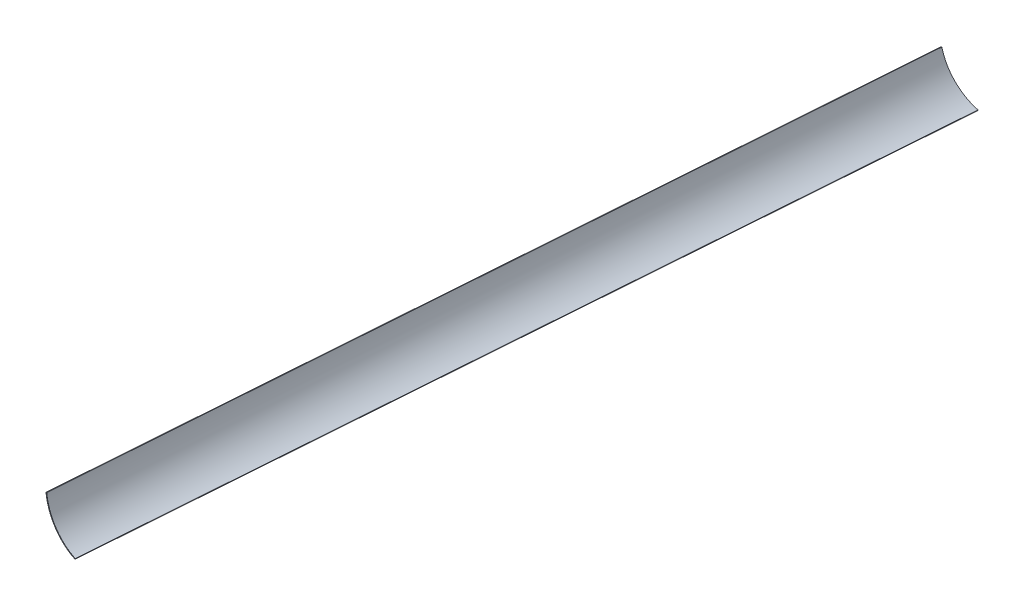
ISO-10303-21;
HEADER;
FILE_DESCRIPTION(('STEP AP214'),'2;1');
FILE_NAME('part.step','',(''),(''),'','','');
FILE_SCHEMA(('AUTOMOTIVE_DESIGN { 1 0 10303 214 1 1 1 1 }'));
ENDSEC;
DATA;
#1=APPLICATION_CONTEXT('core data for automotive mechanical design processes');
#2=APPLICATION_PROTOCOL_DEFINITION('international standard','automotive_design',2000,#1);
#3=PRODUCT_CONTEXT('',#1,'mechanical');
#4=PRODUCT('Part','Part','',(#3));
#5=PRODUCT_RELATED_PRODUCT_CATEGORY('part','',(#4));
#6=PRODUCT_DEFINITION_FORMATION('','',#4);
#7=PRODUCT_DEFINITION_CONTEXT('part definition',#1,'design');
#8=PRODUCT_DEFINITION('design','',#6,#7);
#9=PRODUCT_DEFINITION_SHAPE('','',#8);
#10=(LENGTH_UNIT() NAMED_UNIT(*) SI_UNIT(.MILLI.,.METRE.));
#11=(NAMED_UNIT(*) PLANE_ANGLE_UNIT() SI_UNIT($,.RADIAN.));
#12=(NAMED_UNIT(*) SI_UNIT($,.STERADIAN.) SOLID_ANGLE_UNIT());
#13=UNCERTAINTY_MEASURE_WITH_UNIT(LENGTH_MEASURE(1.E-05),#10,'distance_accuracy_value','');
#14=(GEOMETRIC_REPRESENTATION_CONTEXT(3) GLOBAL_UNCERTAINTY_ASSIGNED_CONTEXT((#13)) GLOBAL_UNIT_ASSIGNED_CONTEXT((#10,
#11,#12)) REPRESENTATION_CONTEXT('',''));
#15=CARTESIAN_POINT('',(0.,0.,0.));
#16=DIRECTION('',(0.,0.,1.));
#17=DIRECTION('',(1.,0.,0.));
#18=AXIS2_PLACEMENT_3D('',#15,#16,#17);
#19=CARTESIAN_POINT('',(-1379.80458779668,7.33323315577682,3100.));
#20=CARTESIAN_POINT('',(-1348.63525530115,-116.892778389307,3100.));
#21=CARTESIAN_POINT('',(-1252.05296410028,-214.207095447711,3100.));
#22=CARTESIAN_POINT('',(-1128.0658401185,-246.313517225056,3100.));
#23=CARTESIAN_POINT('',(-1384.65422967966,6.11641794570197,3100.01828527611));
#24=CARTESIAN_POINT('',(-1353.03897030043,-119.885401330332,3100.11430979239));
#25=CARTESIAN_POINT('',(-1255.07473053113,-218.585417035561,3100.20533357544));
#26=CARTESIAN_POINT('',(-1129.31762698355,-251.147610987102,3100.25410065771));
#27=B_SPLINE_SURFACE_WITH_KNOTS('',1,3,((#19,#20,#21,#22),(#23,#24,#25,#26)),.UNSPECIFIED.,.F.,
.F.,.F.,(2,2),(4,4),(0.,1.),(0.,1.),.UNSPECIFIED.);
#28=CARTESIAN_POINT('',(-1129.31762698355,-251.147610987101,3100.25410065771));
#29=CARTESIAN_POINT('',(-1128.0658401185,-246.313517225056,3100.));
#30=B_SPLINE_CURVE_WITH_KNOTS('',1,(#28,#29),.UNSPECIFIED.,.F.,.F.,(2,2),(0.,1.),.UNSPECIFIED.);
#31=CARTESIAN_POINT('',(-1129.31762702784,-251.147610813735,3100.25410373771));
#32=VERTEX_POINT('',#31);
#33=CARTESIAN_POINT('',(-1128.0658401185,-246.313517225056,3100.));
#34=VERTEX_POINT('',#33);
#35=EDGE_CURVE('E181',#32,#34,#30,.T.);
#36=CARTESIAN_POINT('',(-1129.31762698355,-251.147610987102,3100.25410065771));
#37=CARTESIAN_POINT('',(-1255.07473053113,-218.585417035561,3100.20533357544));
#38=CARTESIAN_POINT('',(-1353.03897030043,-119.885401330332,3100.11430979239));
#39=CARTESIAN_POINT('',(-1384.65422967966,6.11641794570197,3100.01828527611));
#40=B_SPLINE_CURVE_WITH_KNOTS('',3,(#36,#37,#38,#39),.UNSPECIFIED.,.F.,.F.,(4,4),(0.,1.),.UNSPECIFIED.);
#41=CARTESIAN_POINT('',(-1384.65422963224,6.11641775671269,3100.01828527626));
#42=VERTEX_POINT('',#41);
#43=EDGE_CURVE('E316',#32,#42,#40,.T.);
#44=CARTESIAN_POINT('',(-1384.65422967966,6.11641794570197,3100.01828527611));
#45=CARTESIAN_POINT('',(-1379.80458779668,7.33323315577682,3100.));
#46=B_SPLINE_CURVE_WITH_KNOTS('',1,(#44,#45),.UNSPECIFIED.,.F.,.F.,(2,2),(0.,1.),.UNSPECIFIED.);
#47=CARTESIAN_POINT('',(-1379.80458779668,7.33323315577682,3100.));
#48=VERTEX_POINT('',#47);
#49=EDGE_CURVE('E276',#42,#48,#46,.T.);
#50=CARTESIAN_POINT('',(-1128.0658401185,-246.313517225056,3100.));
#51=CARTESIAN_POINT('',(-1135.81503536736,-244.306865863972,3100.));
#52=CARTESIAN_POINT('',(-1151.09932560899,-239.784126459921,3100.));
#53=CARTESIAN_POINT('',(-1173.3277842374,-231.527805258577,3100.));
#54=CARTESIAN_POINT('',(-1194.8025901661,-221.855369912347,3100.));
#55=CARTESIAN_POINT('',(-1215.46806742937,-210.822918371615,3100.));
#56=CARTESIAN_POINT('',(-1235.26854006149,-198.486548586762,3100.));
#57=CARTESIAN_POINT('',(-1254.14833209677,-184.902358508172,3099.99999999999));
#58=CARTESIAN_POINT('',(-1272.05176756949,-170.126446086227,3099.99999999999));
#59=CARTESIAN_POINT('',(-1288.92317051394,-154.214909271308,3099.99999999999));
#60=CARTESIAN_POINT('',(-1304.7068649644,-137.223846013798,3099.99999999999));
#61=CARTESIAN_POINT('',(-1319.34717495518,-119.20935426408,3100.));
#62=CARTESIAN_POINT('',(-1332.78842452055,-100.227531972536,3100.));
#63=CARTESIAN_POINT('',(-1344.97493769482,-80.3344770895481,3100.00000000001));
#64=CARTESIAN_POINT('',(-1355.85103851227,-59.5862875654996,3100.00000000001));
#65=CARTESIAN_POINT('',(-1365.36105100719,-38.0390613507725,3100.));
#66=CARTESIAN_POINT('',(-1373.44929921388,-15.7488963957491,3100.));
#67=CARTESIAN_POINT('',(-1377.85650451571,-0.430892565790914,3100.));
#68=CARTESIAN_POINT('',(-1379.80458779668,7.33323315577682,3100.));
#69=B_SPLINE_CURVE_WITH_KNOTS('',3,(#50,#51,#52,#53,#54,#55,#56,#57,#58,#59,#60,#61,#62,#63,#64,
#65,#66,#67,#68),.UNSPECIFIED.,.F.,.F.,(4,1,1,1,1,1,1,1,1,1,1,1,1,1,1,1,4),(0.,0.0625,0.125,
0.1875,0.25,0.3125,0.375,0.4375,0.5,0.5625,0.625,0.6875,0.75,0.8125,0.875,0.9375,1.),.UNSPECIFIED.);
#70=EDGE_CURVE('E185',#34,#48,#69,.T.);
#71=ORIENTED_EDGE('',*,*,#35,.F.);
#72=ORIENTED_EDGE('',*,*,#43,.T.);
#73=ORIENTED_EDGE('',*,*,#49,.T.);
#74=ORIENTED_EDGE('',*,*,#70,.F.);
#75=EDGE_LOOP('',(#71,#72,#73,#74));
#76=FACE_BOUND('',#75,.T.);
#77=ADVANCED_FACE('F125',(#76),#27,.F.);
#78=CARTESIAN_POINT('',(-1457.37702883153,422.952179082487,10184.));
#79=CARTESIAN_POINT('',(-1369.68644331387,-46.8779337042288,2176.));
#80=CARTESIAN_POINT('',(-1456.55699051163,415.135017906792,10184.));
#81=CARTESIAN_POINT('',(-1367.59122373363,-54.6351417578669,2176.));
#82=CARTESIAN_POINT('',(-1454.33643845136,399.601363805872,10184.));
#83=CARTESIAN_POINT('',(-1362.8988027916,-69.9250172916127,2176.00000000001));
#84=CARTESIAN_POINT('',(-1449.29867144442,376.692656562234,10184.));
#85=CARTESIAN_POINT('',(-1354.41266573277,-92.1345028176864,2176.));
#86=CARTESIAN_POINT('',(-1442.59184262534,354.269435117115,10184.));
#87=CARTESIAN_POINT('',(-1344.53702058448,-113.567468784971,2176.00000000001));
#88=CARTESIAN_POINT('',(-1434.24780099026,332.418399881585,10184.));
#89=CARTESIAN_POINT('',(-1333.33065117802,-134.171808868392,2176.00000000001));
#90=CARTESIAN_POINT('',(-1424.30955042968,311.239225870394,10184.));
#91=CARTESIAN_POINT('',(-1320.85088635849,-153.897109082483,2176.));
#92=CARTESIAN_POINT('',(-1412.7992861415,290.807384862357,10184.));
#93=CARTESIAN_POINT('',(-1307.15776914826,-172.689798497963,2176.));
#94=CARTESIAN_POINT('',(-1399.77852209125,271.244081514831,10184.));
#95=CARTESIAN_POINT('',(-1292.30621403481,-190.502271343619,2175.99999999999));
#96=CARTESIAN_POINT('',(-1385.2312286704,252.580327148191,10184.));
#97=CARTESIAN_POINT('',(-1276.36124988483,-207.275157499938,2175.99999999999));
#98=CARTESIAN_POINT('',(-1369.32625957832,235.062176594767,10184.));
#99=CARTESIAN_POINT('',(-1259.36379035095,-222.977136001139,2175.99999999999));
#100=CARTESIAN_POINT('',(-1352.28027836581,218.894580245327,10184.));
#101=CARTESIAN_POINT('',(-1241.3485130182,-237.571524432542,2175.99999999999));
#102=CARTESIAN_POINT('',(-1334.12506527556,204.067444978712,10184.));
#103=CARTESIAN_POINT('',(-1222.37421068575,-250.993591225737,2176.));
#104=CARTESIAN_POINT('',(-1314.96994412452,190.660871010722,10184.));
#105=CARTESIAN_POINT('',(-1202.48956177348,-263.190369160615,2176.));
#106=CARTESIAN_POINT('',(-1294.88491996184,178.709225678633,10184.));
#107=CARTESIAN_POINT('',(-1181.74837323622,-274.102925858996,2176.00000000001));
#108=CARTESIAN_POINT('',(-1273.96080652941,168.271079555641,10184.));
#109=CARTESIAN_POINT('',(-1160.20173785149,-283.675485886518,2176.));
#110=CARTESIAN_POINT('',(-1252.27726267467,159.392028611273,10184.));
#111=CARTESIAN_POINT('',(-1137.90220338303,-291.850581469207,2176.));
#112=CARTESIAN_POINT('',(-1237.37240446045,154.547129733598,10184.));
#113=CARTESIAN_POINT('',(-1122.5684220074,-296.331300072351,2176.));
#114=CARTESIAN_POINT('',(-1229.82140097494,152.401408185199,10184.));
#115=CARTESIAN_POINT('',(-1114.79337565897,-298.319811843785,2176.));
#116=B_SPLINE_SURFACE_WITH_KNOTS('',3,1,((#78,#79),(#80,#81),(#82,#83),(#84,#85),(#86,#87),(#88,
#89),(#90,#91),(#92,#93),(#94,#95),(#96,#97),(#98,#99),(#100,#101),(#102,#103),(#104,#105),
(#106,#107),(#108,#109),(#110,#111),(#112,#113),(#114,#115)),.UNSPECIFIED.,.F.,.F.,.F.,(4,1,1,1,
1,1,1,1,1,1,1,1,1,1,1,1,4),(2,2),(0.,0.0625,0.125,0.1875,0.25,0.3125,0.375,0.4375,0.5,0.5625,
0.625,0.6875,0.75,0.8125,0.875,0.9375,1.),(-0.15,1.15),.UNSPECIFIED.);
#117=OFFSET_SURFACE('',#116,-5.,.F.);
#118=CARTESIAN_POINT('',(-1452.25298162443,368.298261519233,9262.90361830256));
#119=CARTESIAN_POINT('',(-1452.04608023814,366.625741629008,9262.93430076441));
#120=CARTESIAN_POINT('',(-1451.82614596844,364.954898260901,9262.9669024388));
#121=CARTESIAN_POINT('',(-1451.36021003972,361.616650376192,9263.03594601212));
#122=CARTESIAN_POINT('',(-1451.1142041146,359.949246468034,9263.07238853954));
#123=CARTESIAN_POINT('',(-1450.33606428017,354.945941047444,9263.18762998402));
#124=CARTESIAN_POINT('',(-1449.76470343824,351.616184442768,9263.27221003373));
#125=CARTESIAN_POINT('',(-1448.5180124777,344.976444200462,9263.4566630173));
#126=CARTESIAN_POINT('',(-1447.84267513345,341.66646195363,9263.55653701398));
#127=CARTESIAN_POINT('',(-1446.38844208332,335.068559002385,9263.77145222242));
#128=CARTESIAN_POINT('',(-1445.60950968872,331.780646549473,9263.88649880751));
#129=CARTESIAN_POINT('',(-1443.94907676784,325.231390372022,9264.13148594485));
#130=CARTESIAN_POINT('',(-1443.06757506807,321.970046951918,9264.26142666751));
#131=CARTESIAN_POINT('',(-1440.91040960205,314.45889358769,9264.57903093214));
#132=CARTESIAN_POINT('',(-1439.59783008432,310.219852035575,9264.77201700204));
#133=CARTESIAN_POINT('',(-1436.79920261991,301.800485557913,9265.1828906871));
#134=CARTESIAN_POINT('',(-1435.31314600845,297.620163576967,9265.4007795461));
#135=CARTESIAN_POINT('',(-1432.17011267593,289.325276980257,9265.86085070593));
#136=CARTESIAN_POINT('',(-1430.51312385109,285.210717044989,9266.10303472708));
#137=CARTESIAN_POINT('',(-1427.03144267828,277.054725635719,9266.61086641302));
#138=CARTESIAN_POINT('',(-1425.20675264507,273.01329315327,9266.87651375395));
#139=CARTESIAN_POINT('',(-1421.39270934268,265.010728894227,9267.43060545733));
#140=CARTESIAN_POINT('',(-1419.40336481656,261.049592867828,9267.7190486093));
#141=CARTESIAN_POINT('',(-1415.26320108587,253.214352156569,9268.31793669087));
#142=CARTESIAN_POINT('',(-1413.11238114658,249.340247867816,9268.62838172059));
#143=CARTESIAN_POINT('',(-1408.65332076023,241.685350727352,9269.27041496852));
#144=CARTESIAN_POINT('',(-1406.34508036562,237.904557844547,9269.6020031797));
#145=CARTESIAN_POINT('',(-1402.76792233447,232.308453793716,9270.11446554589));
#146=CARTESIAN_POINT('',(-1401.55636323337,230.455542502083,9270.28780540412));
#147=CARTESIAN_POINT('',(-1399.09538017192,226.775529398441,9270.63941601341));
#148=CARTESIAN_POINT('',(-1397.84595708164,224.94842699478,9270.81768665115));
#149=CARTESIAN_POINT('',(-1395.30972546769,221.320767348057,9271.17905368463));
#150=CARTESIAN_POINT('',(-1394.02291577455,219.520210938017,9271.36215023131));
#151=CARTESIAN_POINT('',(-1391.41249839927,215.946460359045,9271.73304460889));
#152=CARTESIAN_POINT('',(-1390.08889069279,214.17326620821,9271.9208424429));
#153=CARTESIAN_POINT('',(-1387.40555089931,210.654928951877,9272.30101166384));
#154=CARTESIAN_POINT('',(-1386.0458188601,208.909785809271,9272.49338304472));
#155=CARTESIAN_POINT('',(-1383.29087034921,205.448240776802,9272.88256433276));
#156=CARTESIAN_POINT('',(-1381.89565389071,203.731838876258,9273.07937423827));
#157=CARTESIAN_POINT('',(-1379.07043601641,200.328695112741,9273.47726023879));
#158=CARTESIAN_POINT('',(-1377.64043803017,198.64195035352,9273.67833591295));
#159=CARTESIAN_POINT('',(-1374.7460450928,195.298744061346,9274.08463286453));
#160=CARTESIAN_POINT('',(-1373.28165013958,193.642282530244,9274.28985414221));
#161=CARTESIAN_POINT('',(-1370.31920263497,190.360222304023,9274.70433146374));
#162=CARTESIAN_POINT('',(-1368.82114976787,188.734623898678,9274.91358754545));
#163=CARTESIAN_POINT('',(-1365.79207660155,185.514952995089,9275.33599268298));
#164=CARTESIAN_POINT('',(-1364.26105629366,183.920880505148,9275.54914173983));
#165=CARTESIAN_POINT('',(-1361.16687828192,180.765202040182,9275.97915359633));
#166=CARTESIAN_POINT('',(-1359.60372525124,179.203591409632,9276.19601585521));
#167=CARTESIAN_POINT('',(-1356.44567851587,176.113324190867,9276.63335446784));
#168=CARTESIAN_POINT('',(-1354.85078483251,174.584667580502,9276.85383081916));
#169=CARTESIAN_POINT('',(-1351.63003872259,171.561008849347,9277.29824641794));
#170=CARTESIAN_POINT('',(-1350.00418803676,170.066004846509,9277.52218547057));
#171=CARTESIAN_POINT('',(-1346.72216843914,167.110148925971,9277.97339693883));
#172=CARTESIAN_POINT('',(-1345.06599882852,165.649297797239,9278.20066943129));
#173=CARTESIAN_POINT('',(-1340.05230597203,161.318012212143,9278.8873509111));
#174=CARTESIAN_POINT('',(-1336.65030205207,158.49950572478,9279.35152679841));
#175=CARTESIAN_POINT('',(-1329.73339031695,153.005630699711,9280.29151994037));
#176=CARTESIAN_POINT('',(-1326.21846252967,150.330287707948,9280.76733925073));
#177=CARTESIAN_POINT('',(-1318.74121409452,144.87950539396,9281.77536453283));
#178=CARTESIAN_POINT('',(-1314.76821350373,142.118886579607,9282.30861752558));
#179=CARTESIAN_POINT('',(-1306.70086139528,136.779527930271,9283.38623256947));
#180=CARTESIAN_POINT('',(-1302.60645842315,134.200866826467,9283.93059929965));
#181=CARTESIAN_POINT('',(-1294.30509032659,129.230794484714,9285.0288721934));
#182=CARTESIAN_POINT('',(-1290.09809192547,126.839439442126,9285.58278115949));
#183=CARTESIAN_POINT('',(-1281.58039234176,122.24936994947,9286.6985366361));
#184=CARTESIAN_POINT('',(-1277.2696741027,120.050687463722,9287.26038444578));
#185=CARTESIAN_POINT('',(-1268.53317349418,115.840505892056,9288.39310348303));
#186=CARTESIAN_POINT('',(-1264.10693870983,113.829954322343,9288.96400504972));
#187=CARTESIAN_POINT('',(-1255.16882373845,110.011924398028,9290.1105386108));
#188=CARTESIAN_POINT('',(-1250.6569547666,108.204419662811,9290.68616998021));
#189=CARTESIAN_POINT('',(-1243.83243906721,105.648318291318,9291.55203103541));
#190=CARTESIAN_POINT('',(-1241.54837612694,104.822217487671,9291.84102514915));
#191=CARTESIAN_POINT('',(-1236.96215535164,103.221966366877,9292.41967523706));
#192=CARTESIAN_POINT('',(-1234.65999750987,102.447816069063,9292.70933121146));
#193=CARTESIAN_POINT('',(-1230.03973267559,100.952143261131,9293.28899383606));
#194=CARTESIAN_POINT('',(-1227.7216323951,100.230599928942,9293.57900030083));
#195=CARTESIAN_POINT('',(-1223.06974470786,98.8401146590862,9294.15928658571));
#196=CARTESIAN_POINT('',(-1220.73595731256,98.1711726830098,9294.44956640562));
#197=CARTESIAN_POINT('',(-1218.39490874817,97.5286873239776,9294.73988695561));
#198=B_SPLINE_CURVE_WITH_KNOTS('',3,(#118,#119,#120,#121,#122,#123,#124,#125,#126,#127,#128,
#129,#130,#131,#132,#133,#134,#135,#136,#137,#138,#139,#140,#141,#142,#143,#144,#145,#146,#147,
#148,#149,#150,#151,#152,#153,#154,#155,#156,#157,#158,#159,#160,#161,#162,#163,#164,#165,#166,
#167,#168,#169,#170,#171,#172,#173,#174,#175,#176,#177,#178,#179,#180,#181,#182,#183,#184,#185,
#186,#187,#188,#189,#190,#191,#192,#193,#194,#195,#196,#197),.UNSPECIFIED.,.F.,.F.,(4,2,2,2,2,2,
2,2,2,2,2,2,2,2,2,2,2,2,2,2,2,2,2,2,2,2,2,2,2,2,2,2,2,2,2,2,2,2,2,4),(0.,5.05653419065832,
10.1138970613079,20.2504977697574,30.3878032187989,40.5287084543155,50.6697297235684,
63.9911172988844,77.3131705319316,90.6361677534362,103.95898110717,117.281087481284,
130.603254475868,143.925417031199,150.586920220335,157.248270450095,163.909829272559,
170.571392500686,177.232946915743,183.894498854934,190.555396587767,197.216294727779,
203.87725537589,210.538217778102,217.19821821296,223.858214171069,230.517836733713,
237.177612989155,250.50007183074,263.824900044654,278.421597666344,293.024572880371,
307.631912613922,322.241671131039,336.921442727619,351.599304861362,358.936791256475,
366.274280382331,373.60884935115,380.943412964195),.UNSPECIFIED.);
#199=CARTESIAN_POINT('',(-1452.25298162816,368.298261515201,9262.90361825431));
#200=VERTEX_POINT('',#199);
#201=CARTESIAN_POINT('',(-1218.39490873438,97.5286872400731,9294.73988695537));
#202=VERTEX_POINT('',#201);
#203=EDGE_CURVE('E138',#200,#202,#198,.T.);
#204=ORIENTED_EDGE('',*,*,#203,.F.);
#205=CARTESIAN_POINT('',(-1374.51411635579,-48.1822254409975,2176.02365809933));
#206=CARTESIAN_POINT('',(-1377.89415413041,-30.082677645431,2484.02186715826));
#207=CARTESIAN_POINT('',(-1381.27419190504,-11.9831298498645,2792.02007621718));
#208=CARTESIAN_POINT('',(-1384.65422967966,6.11641794570201,3100.01828527611));
#209=CARTESIAN_POINT('',(-1407.18781484383,126.780069916145,5153.33967900231));
#210=CARTESIAN_POINT('',(-1429.71074522153,247.451487460675,7206.66073379324));
#211=CARTESIAN_POINT('',(-1452.22094930751,368.126539282932,9259.98171472388));
#212=CARTESIAN_POINT('',(-1455.59747992041,386.227797056271,9567.97986186348));
#213=CARTESIAN_POINT('',(-1458.97401053331,404.329054829609,9875.97800900308));
#214=CARTESIAN_POINT('',(-1462.3505411462,422.430312602948,10183.9761561427));
#215=B_SPLINE_CURVE_WITH_KNOTS('',3,(#205,#206,#207,#208,#209,#210,#211,#212,#213,#214),
.UNSPECIFIED.,.F.,.F.,(4,3,3,4),(-4.01112496606842,-3.08548074312956,3.08548074312956,
4.01112496606842),.UNSPECIFIED.);
#216=EDGE_CURVE('E275',#42,#200,#215,.T.);
#217=ORIENTED_EDGE('',*,*,#216,.F.);
#218=ORIENTED_EDGE('',*,*,#43,.F.);
#219=CARTESIAN_POINT('',(-1219.62027300974,102.325090383537,9379.95108614277));
#220=CARTESIAN_POINT('',(-1219.04649883333,100.079184994849,9340.0511262224));
#221=CARTESIAN_POINT('',(-1218.47272465691,97.8332796061621,9300.15116630204));
#222=CARTESIAN_POINT('',(-1217.8989504805,95.5873742174748,9260.25120638167));
#223=CARTESIAN_POINT('',(-1188.37137522939,-19.9914424967697,7206.91887200523));
#224=CARTESIAN_POINT('',(-1158.84426705028,-135.569758843066,5153.58650275702));
#225=CARTESIAN_POINT('',(-1129.31762698355,-251.147610987101,3100.25410065771));
#226=B_SPLINE_CURVE_WITH_KNOTS('',3,(#219,#220,#221,#222,#223,#224,#225),.UNSPECIFIED.,.F.,.F.,
(4,3,4),(-3.20509360953105,-3.08519189569358,3.08519189569358),.UNSPECIFIED.);
#227=EDGE_CURVE('E281',#202,#32,#226,.T.);
#228=ORIENTED_EDGE('',*,*,#227,.F.);
#229=EDGE_LOOP('',(#204,#217,#218,#228));
#230=FACE_BOUND('',#229,.T.);
#231=ADVANCED_FACE('F292',(#230),#117,.F.);
#232=CARTESIAN_POINT('',(-1457.37702883153,422.952179082487,10184.));
#233=CARTESIAN_POINT('',(-1448.57290581317,375.781298807418,9379.99787463126));
#234=CARTESIAN_POINT('',(-1447.25888434872,368.741012222481,9260.));
#235=CARTESIAN_POINT('',(-1379.80458779668,7.33323315577682,3100.));
#236=CARTESIAN_POINT('',(-1369.68644331387,-46.8779337042288,2176.));
#237=CARTESIAN_POINT('',(-1456.55699051163,415.135017906792,10184.));
#238=CARTESIAN_POINT('',(-1447.62483946585,367.970156917132,9379.99787463126));
#239=CARTESIAN_POINT('',(-1446.29170972955,360.930768714716,9260.));
#240=CARTESIAN_POINT('',(-1377.85650451571,-0.430892565790914,3100.));
#241=CARTESIAN_POINT('',(-1367.59122373363,-54.6351417578669,2176.));
#242=CARTESIAN_POINT('',(-1454.33643845136,399.601363805872,10184.));
#243=CARTESIAN_POINT('',(-1445.15611210157,352.460978151642,9379.99787463123));
#244=CARTESIAN_POINT('',(-1443.78594202908,345.425242910008,9259.99999999997));
#245=CARTESIAN_POINT('',(-1373.44929921388,-15.7488963957491,3100.));
#246=CARTESIAN_POINT('',(-1362.8988027916,-69.9250172916127,2176.00000000001));
#247=CARTESIAN_POINT('',(-1449.29867144442,376.692656562234,10184.));
#248=CARTESIAN_POINT('',(-1439.77212920417,329.622472674616,9379.99787463126));
#249=CARTESIAN_POINT('',(-1438.35028617,322.59721509532,9260.00000000001));
#250=CARTESIAN_POINT('',(-1365.36105100719,-38.0390613507725,3100.));
#251=CARTESIAN_POINT('',(-1354.41266573277,-92.1345028176864,2176.));
#252=CARTESIAN_POINT('',(-1442.59184262534,354.269435117115,10184.));
#253=CARTESIAN_POINT('',(-1432.74715165088,307.298672746584,9379.99787463125));
#254=CARTESIAN_POINT('',(-1431.27782469755,300.288253897643,9259.99999999999));
#255=CARTESIAN_POINT('',(-1355.85103851227,-59.5862875654996,3100.00000000001));
#256=CARTESIAN_POINT('',(-1344.53702058448,-113.567468784971,2176.00000000001));
#257=CARTESIAN_POINT('',(-1434.24780099026,332.418399881585,10184.));
#258=CARTESIAN_POINT('',(-1424.11573269166,285.572805537027,9379.99787463125));
#259=CARTESIAN_POINT('',(-1422.60351447346,278.581068102742,9259.99999999999));
#260=CARTESIAN_POINT('',(-1344.97493769482,-80.3344770895481,3100.00000000001));
#261=CARTESIAN_POINT('',(-1333.33065117802,-134.171808868392,2176.00000000001));
#262=CARTESIAN_POINT('',(-1424.30955042968,311.239225870394,10184.));
#263=CARTESIAN_POINT('',(-1413.92231444054,264.539600259962,9379.99787463125));
#264=CARTESIAN_POINT('',(-1412.37201226762,257.569648760447,9259.99999999999));
#265=CARTESIAN_POINT('',(-1332.78842452055,-100.227531972536,3100.));
#266=CARTESIAN_POINT('',(-1320.85088635849,-153.897109082483,2176.));
#267=CARTESIAN_POINT('',(-1412.7992861415,290.807384862357,10184.));
#268=CARTESIAN_POINT('',(-1402.19289201191,244.272329851853,9379.99787463126));
#269=CARTESIAN_POINT('',(-1400.60988033459,237.326940628474,9260.));
#270=CARTESIAN_POINT('',(-1319.34717495518,-119.20935426408,3100.));
#271=CARTESIAN_POINT('',(-1307.15776914826,-172.689798497963,2176.));
#272=CARTESIAN_POINT('',(-1399.77852209125,271.244081514831,10184.));
#273=CARTESIAN_POINT('',(-1388.9883167846,224.884809651762,9379.99787463124));
#274=CARTESIAN_POINT('',(-1387.37787116166,217.96565618501,9259.99999999998));
#275=CARTESIAN_POINT('',(-1304.7068649644,-137.223846013798,3099.99999999999));
#276=CARTESIAN_POINT('',(-1292.30621403481,-190.502271343619,2175.99999999999));
#277=CARTESIAN_POINT('',(-1385.2312286704,252.580327148191,10184.));
#278=CARTESIAN_POINT('',(-1374.30069741011,206.410898199694,9379.99787463126));
#279=CARTESIAN_POINT('',(-1372.6693080413,199.520078919561,9260.));
#280=CARTESIAN_POINT('',(-1288.92317051394,-154.214909271308,3099.99999999999));
#281=CARTESIAN_POINT('',(-1276.36124988483,-207.275157499938,2175.99999999999));
#282=CARTESIAN_POINT('',(-1369.32625957832,235.062176594767,10184.));
#283=CARTESIAN_POINT('',(-1358.28604242427,189.075091076592,9379.99787463124));
#284=CARTESIAN_POINT('',(-1356.63828235978,182.211486679854,9259.99999999998));
#285=CARTESIAN_POINT('',(-1272.05176756949,-170.126446086227,3099.99999999999));
#286=CARTESIAN_POINT('',(-1259.36379035095,-222.977136001139,2175.99999999999));
#287=CARTESIAN_POINT('',(-1352.28027836581,218.894580245327,10184.));
#288=CARTESIAN_POINT('',(-1341.14274401136,173.065444591007,9379.99787463126));
#289=CARTESIAN_POINT('',(-1339.48045928724,166.225414320958,9260.));
#290=CARTESIAN_POINT('',(-1254.14833209677,-184.902358508172,3099.99999999999));
#291=CARTESIAN_POINT('',(-1241.3485130182,-237.571524432542,2175.99999999999));
#292=CARTESIAN_POINT('',(-1334.12506527556,204.067444978712,10184.));
#293=CARTESIAN_POINT('',(-1322.90529447112,158.37937801057,9379.99787463124));
#294=CARTESIAN_POINT('',(-1321.23073589981,151.560402339737,9259.99999999998));
#295=CARTESIAN_POINT('',(-1235.26854006149,-198.486548586762,3100.));
#296=CARTESIAN_POINT('',(-1222.37421068575,-250.993591225737,2176.));
#297=CARTESIAN_POINT('',(-1314.96994412452,190.660871010722,10184.));
#298=CARTESIAN_POINT('',(-1303.67692883074,145.094267401957,9379.99787463127));
#299=CARTESIAN_POINT('',(-1301.99143846863,138.293420221722,9260.00000000001));
#300=CARTESIAN_POINT('',(-1215.46806742937,-210.822918371615,3100.));
#301=CARTESIAN_POINT('',(-1202.48956177348,-263.190369160615,2176.));
#302=CARTESIAN_POINT('',(-1294.88491996184,178.709225678633,10184.));
#303=CARTESIAN_POINT('',(-1283.52602585292,133.246946429252,9379.99787463122));
#304=CARTESIAN_POINT('',(-1281.83070303196,126.461669731984,9259.99999999996));
#305=CARTESIAN_POINT('',(-1194.8025901661,-221.855369912347,3100.));
#306=CARTESIAN_POINT('',(-1181.74837323622,-274.102925858996,2176.00000000001));
#307=CARTESIAN_POINT('',(-1273.96080652941,168.271079555641,10184.));
#308=CARTESIAN_POINT('',(-1262.53941130001,122.895705034088,9379.99787463127));
#309=CARTESIAN_POINT('',(-1260.8347601435,116.1233989277,9260.00000000001));
#310=CARTESIAN_POINT('',(-1173.3277842374,-231.527805258577,3100.));
#311=CARTESIAN_POINT('',(-1160.20173785149,-283.675485886518,2176.));
#312=CARTESIAN_POINT('',(-1252.27726267467,159.392028611273,10184.));
#313=CARTESIAN_POINT('',(-1240.79402207031,114.087331113565,9379.99787463124));
#314=CARTESIAN_POINT('',(-1239.08014044871,107.325573601987,9259.99999999999));
#315=CARTESIAN_POINT('',(-1151.09932560899,-239.784126459921,3100.));
#316=CARTESIAN_POINT('',(-1137.90220338303,-291.850581469207,2176.));
#317=CARTESIAN_POINT('',(-1237.37240446045,154.547129733598,10184.));
#318=CARTESIAN_POINT('',(-1225.84610002825,109.278995886582,9379.99787463126));
#319=CARTESIAN_POINT('',(-1224.12579110048,102.522695525219,9260.));
#320=CARTESIAN_POINT('',(-1135.81503536736,-244.306865863972,3100.));
#321=CARTESIAN_POINT('',(-1122.5684220074,-296.331300072351,2176.));
#322=CARTESIAN_POINT('',(-1229.82140097494,152.401408185199,10184.));
#323=CARTESIAN_POINT('',(-1218.27260266937,107.149058178693,9379.99787463126));
#324=CARTESIAN_POINT('',(-1216.54893651541,100.39511356647,9260.));
#325=CARTESIAN_POINT('',(-1128.0658401185,-246.313517225056,3100.));
#326=CARTESIAN_POINT('',(-1114.79337565897,-298.319811843785,2176.));
#327=B_SPLINE_SURFACE_WITH_KNOTS('',3,1,((#232,#233,#234,#235,#236),(#237,#238,#239,#240,#241),
(#242,#243,#244,#245,#246),(#247,#248,#249,#250,#251),(#252,#253,#254,#255,#256),(#257,#258,
#259,#260,#261),(#262,#263,#264,#265,#266),(#267,#268,#269,#270,#271),(#272,#273,#274,#275,
#276),(#277,#278,#279,#280,#281),(#282,#283,#284,#285,#286),(#287,#288,#289,#290,#291),(#292,
#293,#294,#295,#296),(#297,#298,#299,#300,#301),(#302,#303,#304,#305,#306),(#307,#308,#309,#310,
#311),(#312,#313,#314,#315,#316),(#317,#318,#319,#320,#321),(#322,#323,#324,#325,#326)),
.UNSPECIFIED.,.F.,.F.,.F.,(4,1,1,1,1,1,1,1,1,1,1,1,1,1,1,1,4),(2,1,1,1,2),(0.,0.0625,0.125,
0.1875,0.25,0.3125,0.375,0.4375,0.5,0.5625,0.625,0.6875,0.75,0.8125,0.875,0.9375,1.),(-0.15,
-0.0194801744531263,0.,1.,1.15),.UNSPECIFIED.);
#328=CARTESIAN_POINT('',(-1379.80458779668,7.33323315577686,3100.));
#329=CARTESIAN_POINT('',(-1382.61651665826,22.3990335080944,3356.78841338151));
#330=CARTESIAN_POINT('',(-1385.42844551985,37.4648338604119,3613.57682676303));
#331=CARTESIAN_POINT('',(-1391.05230324302,67.5964345650469,4127.15365352606));
#332=CARTESIAN_POINT('',(-1393.8642321046,82.6622349173644,4383.94206690757));
#333=CARTESIAN_POINT('',(-1399.48808982777,112.793835621999,4897.5188936706));
#334=CARTESIAN_POINT('',(-1402.30001868936,127.859635974317,5154.30730705211));
#335=CARTESIAN_POINT('',(-1407.92387641253,157.991236678952,5667.88413381514));
#336=CARTESIAN_POINT('',(-1410.73580527412,173.05703703127,5924.67254719666));
#337=CARTESIAN_POINT('',(-1416.35966299729,203.188637735905,6438.24937395968));
#338=CARTESIAN_POINT('',(-1419.17159185887,218.254438088222,6695.0377873412));
#339=CARTESIAN_POINT('',(-1424.79544958204,248.386038792857,7208.61461410423));
#340=CARTESIAN_POINT('',(-1427.60737844363,263.451839145175,7465.40302748574));
#341=CARTESIAN_POINT('',(-1433.2312361668,293.58343984981,7978.97985424877));
#342=CARTESIAN_POINT('',(-1436.04316502838,308.649240202127,8235.76826763028));
#343=CARTESIAN_POINT('',(-1441.66702275155,338.780840906762,8749.34509439331));
#344=CARTESIAN_POINT('',(-1444.47895161314,353.84664125908,9006.13350777483));
#345=CARTESIAN_POINT('',(-1447.29088047472,368.912441611397,9262.92192115634));
#346=B_SPLINE_CURVE_WITH_KNOTS('',3,(#328,#329,#330,#331,#332,#333,#334,#335,#336,#337,#338,
#339,#340,#341,#342,#343,#344,#345),.UNSPECIFIED.,.F.,.F.,(4,2,2,2,2,2,2,2,4),(0.,
771.736075857909,1543.47215171582,2315.20822757373,3086.94430343164,3858.68037928955,
4630.41645514746,5402.15253100537,6173.88860686328),.UNSPECIFIED.);
#347=CARTESIAN_POINT('',(-1447.29088047472,368.912441611398,9262.92192115635));
#348=VERTEX_POINT('',#347);
#349=EDGE_CURVE('E176',#48,#348,#346,.T.);
#350=CARTESIAN_POINT('',(-1447.29088047473,368.912441611398,9262.92192115636));
#351=CARTESIAN_POINT('',(-1447.08600189782,367.256300364576,9262.9513911917));
#352=CARTESIAN_POINT('',(-1446.86814473982,365.60182813506,9262.98280054517));
#353=CARTESIAN_POINT('',(-1446.40651703334,362.296634228431,9263.04949330508));
#354=CARTESIAN_POINT('',(-1446.16274730127,360.645912434831,9263.08477658948));
#355=CARTESIAN_POINT('',(-1445.39157273041,355.693145688795,9263.19658444495));
#356=CARTESIAN_POINT('',(-1444.82513385292,352.397221755399,9263.27894745286));
#357=CARTESIAN_POINT('',(-1443.58880858766,345.825185961711,9263.45911946048));
#358=CARTESIAN_POINT('',(-1442.91891814337,342.549074883557,9263.55692906588));
#359=CARTESIAN_POINT('',(-1441.47573831357,336.017255526842,9263.76792120417));
#360=CARTESIAN_POINT('',(-1440.70236112839,332.761567057918,9263.88111679205));
#361=CARTESIAN_POINT('',(-1439.0533220031,326.276232881673,9264.12258992649));
#362=CARTESIAN_POINT('',(-1438.17764481339,323.046591133976,9264.25086972163));
#363=CARTESIAN_POINT('',(-1436.43429085245,316.996497425431,9264.5062467453));
#364=CARTESIAN_POINT('',(-1435.57786173257,314.172728418616,9264.63169752872));
#365=CARTESIAN_POINT('',(-1433.78681945798,308.550636101166,9264.89402538873));
#366=CARTESIAN_POINT('',(-1432.85220675997,305.752312641999,9265.03090239858));
#367=CARTESIAN_POINT('',(-1430.90501087112,300.181926484963,9265.31598660102));
#368=CARTESIAN_POINT('',(-1429.89238863489,297.409877727933,9265.46419946719));
#369=CARTESIAN_POINT('',(-1427.79044262293,291.895664077312,9265.7716975647));
#370=CARTESIAN_POINT('',(-1426.70111954396,289.153498912518,9265.93098269547));
#371=CARTESIAN_POINT('',(-1424.44653656582,283.700797590191,9266.26040118605));
#372=CARTESIAN_POINT('',(-1423.28126659112,280.990265685765,9266.43053598517));
#373=CARTESIAN_POINT('',(-1420.87585750214,275.603314296627,9266.78140576778));
#374=CARTESIAN_POINT('',(-1419.63571818625,272.926894903794,9266.96214077982));
#375=CARTESIAN_POINT('',(-1417.07969774994,267.606645700168,9267.33427486646));
#376=CARTESIAN_POINT('',(-1415.76371423643,264.962866087765,9267.52568834576));
#377=CARTESIAN_POINT('',(-1413.05854967211,259.71380058287,9267.9186995696));
#378=CARTESIAN_POINT('',(-1411.66936879361,257.108514599776,9268.12029729016));
#379=CARTESIAN_POINT('',(-1408.81915408818,251.938774887156,9268.53338680188));
#380=CARTESIAN_POINT('',(-1407.35812930142,249.374316073796,9268.74487734804));
#381=CARTESIAN_POINT('',(-1404.36533978002,244.287817765189,9269.17750931961));
#382=CARTESIAN_POINT('',(-1402.83357456387,241.765778558837,9269.39865081071));
#383=CARTESIAN_POINT('',(-1399.70063030695,236.766155837329,9269.85025828362));
#384=CARTESIAN_POINT('',(-1398.09945344238,234.288570931884,9270.08072397308));
#385=CARTESIAN_POINT('',(-1394.82877123013,229.379847078089,9270.55071857678));
#386=CARTESIAN_POINT('',(-1393.15926741278,226.948707091294,9270.79024728803));
#387=CARTESIAN_POINT('',(-1390.17940083934,222.737178434293,9271.21705214193));
#388=CARTESIAN_POINT('',(-1388.88371437981,220.946187837387,9271.40240419289));
#389=CARTESIAN_POINT('',(-1386.2552484684,217.392173370104,9271.77792258577));
#390=CARTESIAN_POINT('',(-1384.92246955033,215.62914909781,9271.9680888584));
#391=CARTESIAN_POINT('',(-1382.22046338231,212.131677910048,9272.35311010672));
#392=CARTESIAN_POINT('',(-1380.85123480202,210.397232041377,9272.54796525351));
#393=CARTESIAN_POINT('',(-1378.07700594469,206.957702161099,9272.94221479694));
#394=CARTESIAN_POINT('',(-1376.6720055502,205.252618245927,9273.14160920849));
#395=CARTESIAN_POINT('',(-1373.82675397161,201.872606502966,9273.54477543934));
#396=CARTESIAN_POINT('',(-1372.38650231504,200.197679079881,9273.74854731729));
#397=CARTESIAN_POINT('',(-1369.47138508768,196.878755821483,9274.1603342186));
#398=CARTESIAN_POINT('',(-1367.99651953378,195.234759971092,9274.36834923987));
#399=CARTESIAN_POINT('',(-1365.01296036372,191.978316688997,9274.7884945419));
#400=CARTESIAN_POINT('',(-1363.50426701275,190.365869010159,9275.0006247904));
#401=CARTESIAN_POINT('',(-1360.45371098156,187.173201644744,9275.42885459422));
#402=CARTESIAN_POINT('',(-1358.91184830187,185.592981957643,9275.64495414949));
#403=CARTESIAN_POINT('',(-1355.79572227996,182.46569992941,9276.08095758283));
#404=CARTESIAN_POINT('',(-1354.22146261682,180.918633863559,9276.30086102847));
#405=CARTESIAN_POINT('',(-1351.04107766398,177.858198671597,9276.74434411598));
#406=CARTESIAN_POINT('',(-1349.43495238007,176.344829539379,9276.96792375719));
#407=CARTESIAN_POINT('',(-1344.56989350648,171.856239965433,9277.64396259075));
#408=CARTESIAN_POINT('',(-1341.26408711378,168.932346901156,9278.10174825729));
#409=CARTESIAN_POINT('',(-1334.53405742218,163.226281706502,9279.03015934609));
#410=CARTESIAN_POINT('',(-1331.10983317711,160.444110708946,9279.50078487094));
#411=CARTESIAN_POINT('',(-1325.88930267576,156.38091192991,9280.21551305419));
#412=CARTESIAN_POINT('',(-1324.13502982035,155.044809887083,9280.45522941626));
#413=CARTESIAN_POINT('',(-1320.59910545582,152.409868635058,9280.93744491956));
#414=CARTESIAN_POINT('',(-1318.81745414734,151.11102915299,9281.1799440404));
#415=CARTESIAN_POINT('',(-1314.0025640183,147.677654196058,9281.83396917443));
#416=CARTESIAN_POINT('',(-1310.94491201741,145.57767719239,9282.24791339639));
#417=CARTESIAN_POINT('',(-1304.75815935521,141.487040347324,9283.08246453686));
#418=CARTESIAN_POINT('',(-1301.62905626676,139.496384227319,9283.50307168157));
#419=CARTESIAN_POINT('',(-1295.30326602194,135.626579822992,9284.35024588601));
#420=CARTESIAN_POINT('',(-1292.10657660584,133.747435275057,9284.77681314485));
#421=CARTESIAN_POINT('',(-1285.64951251775,130.102999886793,9285.63520286912));
#422=CARTESIAN_POINT('',(-1282.38913595353,128.337712436028,9286.06702549055));
#423=CARTESIAN_POINT('',(-1275.80868125603,124.923142646541,9286.93518852812));
#424=CARTESIAN_POINT('',(-1272.48860166684,123.273863141566,9287.37152905433));
#425=CARTESIAN_POINT('',(-1265.78919181236,120.091424241285,9288.24849115321));
#426=CARTESIAN_POINT('',(-1262.40979944456,118.558396753074,9288.68911696734));
#427=CARTESIAN_POINT('',(-1255.59957221223,115.612232164669,9289.5734149134));
#428=CARTESIAN_POINT('',(-1252.16873767557,114.199094300749,9290.0170870259));
#429=CARTESIAN_POINT('',(-1245.2598302444,111.494390442427,9290.90682448322));
#430=CARTESIAN_POINT('',(-1241.78175789444,110.202823047945,9291.35288980041));
#431=CARTESIAN_POINT('',(-1234.78263712941,107.742790409125,9292.2467274647));
#432=CARTESIAN_POINT('',(-1231.26158948301,106.574322966597,9292.69449978118));
#433=CARTESIAN_POINT('',(-1224.18087328616,104.361737427789,9293.59103270972));
#434=CARTESIAN_POINT('',(-1220.62120582896,103.31761582154,9294.03979329353));
#435=CARTESIAN_POINT('',(-1217.04433693291,102.336270870516,9294.48869735618));
#436=B_SPLINE_CURVE_WITH_KNOTS('',3,(#350,#351,#352,#353,#354,#355,#356,#357,#358,#359,#360,
#361,#362,#363,#364,#365,#366,#367,#368,#369,#370,#371,#372,#373,#374,#375,#376,#377,#378,#379,
#380,#381,#382,#383,#384,#385,#386,#387,#388,#389,#390,#391,#392,#393,#394,#395,#396,#397,#398,
#399,#400,#401,#402,#403,#404,#405,#406,#407,#408,#409,#410,#411,#412,#413,#414,#415,#416,#417,
#418,#419,#420,#421,#422,#423,#424,#425,#426,#427,#428,#429,#430,#431,#432,#433,#434,#435),
.UNSPECIFIED.,.F.,.F.,(4,2,2,2,2,2,2,2,2,2,2,2,2,2,2,2,2,2,2,2,2,2,2,2,2,2,2,2,2,2,2,2,2,2,2,2,
2,2,2,2,2,2,4),(0.,5.00696779722701,10.013777893313,20.047712748832,30.082041154334,
40.1249374576576,50.1693327443943,59.02855150042,67.8877185095173,76.7513488925688,
85.6148987683441,94.479626933303,103.344378969492,112.2213926953,121.098385523687,
129.974264196405,138.850203293236,147.725864313203,156.60132665243,163.255731250161,
169.910040127723,176.564592206183,183.219166136512,189.873829305686,196.528489230581,
203.183097005006,209.837704671122,216.491560748826,223.145415620517,236.452315500744,
249.759321729781,256.413296512829,263.067222557099,274.261838487125,285.456835257131,
296.652206923222,307.847911725517,319.043889912485,330.25238738393,341.460813449153,
352.669110415618,363.877207202174,375.084987537517),.UNSPECIFIED.);
#437=CARTESIAN_POINT('',(-1217.04433694593,102.336270874019,9294.4886973532));
#438=VERTEX_POINT('',#437);
#439=EDGE_CURVE('E166',#348,#438,#436,.T.);
#440=CARTESIAN_POINT('',(-1229.82140097494,152.401408185199,10184.));
#441=CARTESIAN_POINT('',(-1218.27260266937,107.149058178693,9379.99787463126));
#442=CARTESIAN_POINT('',(-1216.54893651541,100.39511356647,9260.));
#443=CARTESIAN_POINT('',(-1128.0658401185,-246.313517225056,3100.));
#444=CARTESIAN_POINT('',(-1114.79337565897,-298.319811843785,2176.));
#445=B_SPLINE_CURVE_WITH_KNOTS('',1,(#440,#441,#442,#443,#444),.UNSPECIFIED.,.F.,.F.,(2,1,1,1,
2),(-0.15,-0.0194801744531263,0.,1.,1.15),.UNSPECIFIED.);
#446=EDGE_CURVE('E172',#438,#34,#445,.T.);
#447=ORIENTED_EDGE('',*,*,#349,.T.);
#448=ORIENTED_EDGE('',*,*,#439,.T.);
#449=ORIENTED_EDGE('',*,*,#446,.T.);
#450=ORIENTED_EDGE('',*,*,#70,.T.);
#451=EDGE_LOOP('',(#447,#448,#449,#450));
#452=FACE_BOUND('',#451,.T.);
#453=ADVANCED_FACE('F127',(#452),#327,.T.);
#454=CARTESIAN_POINT('',(-1218.26832306612,107.132289152237,9379.69993799572));
#455=CARTESIAN_POINT('',(-1217.69519421588,104.886563956981,9339.79995866381));
#456=CARTESIAN_POINT('',(-1217.12206536564,102.640838761726,9299.89997933191));
#457=CARTESIAN_POINT('',(-1216.54893651541,100.39511356647,9260.));
#458=CARTESIAN_POINT('',(-1187.05457104977,-15.1744300307061,7206.66666666666));
#459=CARTESIAN_POINT('',(-1157.56020558414,-130.743973627881,5153.33333333334));
#460=CARTESIAN_POINT('',(-1128.0658401185,-246.313517225056,3100.));
#461=CARTESIAN_POINT('',(-1219.62027300974,102.325090383537,9379.95108614277));
#462=CARTESIAN_POINT('',(-1219.04649883333,100.079184994849,9340.0511262224));
#463=CARTESIAN_POINT('',(-1218.47272465691,97.8332796061621,9300.15116630204));
#464=CARTESIAN_POINT('',(-1217.8989504805,95.5873742174748,9260.25120638167));
#465=CARTESIAN_POINT('',(-1188.37137522939,-19.9914424967697,7206.91887200523));
#466=CARTESIAN_POINT('',(-1158.84426705028,-135.569758843066,5153.58650275702));
#467=CARTESIAN_POINT('',(-1129.31762698355,-251.147610987101,3100.25410065771));
#468=B_SPLINE_SURFACE_WITH_KNOTS('',1,3,((#454,#455,#456,#457,#458,#459,#460),(#461,#462,#463,
#464,#465,#466,#467)),.UNSPECIFIED.,.F.,.F.,.F.,(2,2),(4,3,4),(0.,1.),(-3.20509360953105,
-3.08519189569358,3.08519189569358),.UNSPECIFIED.);
#469=DIRECTION('',(0.27011436305484,0.961516709306842,-0.0502379198934476));
#470=VECTOR('',#469,1.);
#471=CARTESIAN_POINT('',(-1217.71962286659,99.9324791042538,9294.61429214994));
#472=LINE('',#471,#470);
#473=EDGE_CURVE('E14',#202,#438,#472,.T.);
#474=ORIENTED_EDGE('',*,*,#446,.F.);
#475=ORIENTED_EDGE('',*,*,#473,.F.);
#476=ORIENTED_EDGE('',*,*,#227,.T.);
#477=ORIENTED_EDGE('',*,*,#35,.T.);
#478=EDGE_LOOP('',(#474,#475,#476,#477));
#479=FACE_BOUND('',#478,.T.);
#480=ADVANCED_FACE('F179',(#479),#468,.T.);
#481=CARTESIAN_POINT('',(-1369.68644331387,-46.8779337042287,2176.));
#482=CARTESIAN_POINT('',(-1373.05915814147,-28.8075447508935,2484.));
#483=CARTESIAN_POINT('',(-1376.43187296907,-10.7371557975583,2792.));
#484=CARTESIAN_POINT('',(-1379.80458779668,7.33323315577686,3100.));
#485=CARTESIAN_POINT('',(-1402.28935331402,127.802492844678,5153.33333333333));
#486=CARTESIAN_POINT('',(-1424.77411883137,248.27175253358,7206.66666666667));
#487=CARTESIAN_POINT('',(-1447.25888434872,368.741012222481,9260.));
#488=CARTESIAN_POINT('',(-1450.63159917632,386.811401175817,9568.));
#489=CARTESIAN_POINT('',(-1454.00431400393,404.881790129152,9876.));
#490=CARTESIAN_POINT('',(-1457.37702883153,422.952179082487,10184.));
#491=CARTESIAN_POINT('',(-1374.51411635579,-48.1822254409975,2176.02365809933));
#492=CARTESIAN_POINT('',(-1377.89415413041,-30.082677645431,2484.02186715826));
#493=CARTESIAN_POINT('',(-1381.27419190504,-11.9831298498645,2792.02007621718));
#494=CARTESIAN_POINT('',(-1384.65422967966,6.11641794570201,3100.01828527611));
#495=CARTESIAN_POINT('',(-1407.18781484383,126.780069916145,5153.33967900231));
#496=CARTESIAN_POINT('',(-1429.71074522153,247.451487460675,7206.66073379324));
#497=CARTESIAN_POINT('',(-1452.22094930751,368.126539282932,9259.98171472388));
#498=CARTESIAN_POINT('',(-1455.59747992041,386.227797056271,9567.97986186348));
#499=CARTESIAN_POINT('',(-1458.97401053331,404.329054829609,9875.97800900308));
#500=CARTESIAN_POINT('',(-1462.3505411462,422.430312602948,10183.9761561427));
#501=B_SPLINE_SURFACE_WITH_KNOTS('',1,3,((#481,#482,#483,#484,#485,#486,#487,#488,#489,#490),
(#491,#492,#493,#494,#495,#496,#497,#498,#499,#500)),.UNSPECIFIED.,.F.,.F.,.F.,(2,2),(4,3,3,4),
(0.,1.),(-4.01112496606842,-3.08548074312956,3.08548074312956,4.01112496606842),.UNSPECIFIED.);
#502=DIRECTION('',(0.992420229941524,0.122836018433203,0.0036605707602888));
#503=VECTOR('',#502,1.);
#504=CARTESIAN_POINT('',(-1449.77193104958,368.605351565314,9262.91276972944));
#505=LINE('',#504,#503);
#506=EDGE_CURVE('E147',#200,#348,#505,.T.);
#507=ORIENTED_EDGE('',*,*,#216,.T.);
#508=ORIENTED_EDGE('',*,*,#506,.T.);
#509=ORIENTED_EDGE('',*,*,#349,.F.);
#510=ORIENTED_EDGE('',*,*,#49,.F.);
#511=EDGE_LOOP('',(#507,#508,#509,#510));
#512=FACE_BOUND('',#511,.T.);
#513=ADVANCED_FACE('F211',(#512),#501,.T.);
#514=CARTESIAN_POINT('',(-1452.30309884604,368.2920583003,9262.90343344371));
#515=CARTESIAN_POINT('',(-1450.33769795934,352.404447641237,9263.19498247679));
#516=CARTESIAN_POINT('',(-1447.22697278417,336.865574787769,9263.6559329459));
#517=CARTESIAN_POINT('',(-1438.80629388484,306.459472659429,9264.89660297376));
#518=CARTESIAN_POINT('',(-1433.49567690105,291.592050384846,9265.67644683234));
#519=CARTESIAN_POINT('',(-1425.44999393391,273.436799850398,9266.84839446477));
#520=CARTESIAN_POINT('',(-1423.7701587594,269.827299673577,9267.0926768684));
#521=CARTESIAN_POINT('',(-1420.26653376252,262.652169951765,9267.60117460928));
#522=CARTESIAN_POINT('',(-1418.44979877942,259.101363427745,9267.86436434709));
#523=CARTESIAN_POINT('',(-1412.82519292304,248.592644817979,9268.67749247711));
#524=CARTESIAN_POINT('',(-1408.83602320749,241.763121828046,9269.25199620776));
#525=CARTESIAN_POINT('',(-1396.16799778761,221.790028215992,9271.06755612304));
#526=CARTESIAN_POINT('',(-1386.78965420029,209.161185098384,9272.40062624806));
#527=CARTESIAN_POINT('',(-1371.31885572585,191.249278423551,9274.57253153883));
#528=CARTESIAN_POINT('',(-1365.92702338226,185.451298342745,9275.32533789589));
#529=CARTESIAN_POINT('',(-1357.47791201953,177.019734734782,9276.49726489111));
#530=CARTESIAN_POINT('',(-1354.60707277782,174.259994635748,9276.89422037874));
#531=CARTESIAN_POINT('',(-1348.79073184448,168.872750808126,9277.69577400694));
#532=CARTESIAN_POINT('',(-1345.84041700457,166.240396641351,9278.10104032414));
#533=CARTESIAN_POINT('',(-1330.88162726881,153.379744304465,9280.14876450147));
#534=CARTESIAN_POINT('',(-1318.25453707452,144.050333323969,9281.85503681424));
#535=CARTESIAN_POINT('',(-1298.33664642873,131.473988124973,9284.50331808082));
#536=CARTESIAN_POINT('',(-1291.53412469798,127.518671553332,9285.4009297138));
#537=CARTESIAN_POINT('',(-1281.08090423891,121.947302398943,9286.76867134059));
#538=CARTESIAN_POINT('',(-1277.55487529041,120.150519252453,9287.22814462454));
#539=CARTESIAN_POINT('',(-1270.41837543944,116.679327071573,9288.15409212684));
#540=CARTESIAN_POINT('',(-1266.80859836945,115.005585354176,9288.62046792819));
#541=CARTESIAN_POINT('',(-1248.66043005722,106.995809536774,9290.95484852007));
#542=CARTESIAN_POINT('',(-1233.73732619814,101.687060772744,9292.84168410614));
#543=CARTESIAN_POINT('',(-1218.4085495496,97.4801307373186,9294.74242396733));
#544=CARTESIAN_POINT('',(-1452.25298162443,368.298261519231,9262.90361830254));
#545=CARTESIAN_POINT('',(-1450.28788639208,352.413124255801,9263.19503497747));
#546=CARTESIAN_POINT('',(-1447.17764640713,336.876675065603,9263.65585293981));
#547=CARTESIAN_POINT('',(-1438.75828037067,306.475312416521,9264.89625860057));
#548=CARTESIAN_POINT('',(-1433.44849295083,291.610212134113,9265.67597019418));
#549=CARTESIAN_POINT('',(-1425.40406411044,273.457792097468,9266.8477531017));
#550=CARTESIAN_POINT('',(-1423.7244910293,269.848855266257,9267.09200253615));
#551=CARTESIAN_POINT('',(-1420.221413049,262.674846217862,9267.60043431204));
#552=CARTESIAN_POINT('',(-1418.40496190311,259.124594734211,9267.86359118808));
#553=CARTESIAN_POINT('',(-1412.7812349369,248.617519186541,9268.67662146943));
#554=CARTESIAN_POINT('',(-1408.79268681869,241.789061162384,9269.25106103359));
#555=CARTESIAN_POINT('',(-1396.12663577511,221.819083898412,9271.06643091897));
#556=CARTESIAN_POINT('',(-1386.749754726,209.192214865958,9272.39937752411));
#557=CARTESIAN_POINT('',(-1371.28137643601,191.283116870969,9274.57110210942));
#558=CARTESIAN_POINT('',(-1365.89038101123,185.486039176321,9275.3238495846));
#559=CARTESIAN_POINT('',(-1357.44258968366,177.055797007892,9276.4956889684));
#560=CARTESIAN_POINT('',(-1354.57219932482,174.29648987254,9276.89261551428));
#561=CARTESIAN_POINT('',(-1348.75676709875,168.910090734357,9277.69411220688));
#562=CARTESIAN_POINT('',(-1345.80691284535,166.278149064654,9278.09935047915));
#563=CARTESIAN_POINT('',(-1330.85045307718,153.419508039324,9280.14693672093));
#564=CARTESIAN_POINT('',(-1318.22533654261,144.091562674461,9281.85310453371));
#565=CARTESIAN_POINT('',(-1298.31054809415,131.517188901064,9284.50123880068));
#566=CARTESIAN_POINT('',(-1291.50908611832,127.56249302284,9285.39880295419));
#567=CARTESIAN_POINT('',(-1281.05749613715,121.991999946378,9286.7664756136));
#568=CARTESIAN_POINT('',(-1277.53201709255,120.195499430243,9287.22592630246));
#569=CARTESIAN_POINT('',(-1270.396629889,116.724853390844,9288.15182941925));
#570=CARTESIAN_POINT('',(-1266.78741546236,115.051375084503,9288.61818343678));
#571=CARTESIAN_POINT('',(-1248.64207475418,107.042860137933,9290.95245781072));
#572=CARTESIAN_POINT('',(-1233.72129827465,101.734950371447,9292.83921628302));
#573=CARTESIAN_POINT('',(-1218.39490877427,97.5286873311386,9294.73988695237));
#574=CARTESIAN_POINT('',(-1447.29088047472,368.912441611397,9262.92192115634));
#575=CARTESIAN_POINT('',(-1445.35604804979,353.272195004655,9263.20023306432));
#576=CARTESIAN_POINT('',(-1442.29384670045,337.975712474968,9263.64793154474));
#577=CARTESIAN_POINT('',(-1434.00446708645,308.043605197861,9264.86216224503));
#578=CARTESIAN_POINT('',(-1428.77681471089,293.408405130872,9265.62877829753));
#579=CARTESIAN_POINT('',(-1420.85655683636,275.536232401389,9266.78425180788));
#580=CARTESIAN_POINT('',(-1419.20293359407,271.983072363252,9267.02523696681));
#581=CARTESIAN_POINT('',(-1415.75401567162,264.920021078867,9267.52713755607));
#582=CARTESIAN_POINT('',(-1413.96566721826,261.424724087274,9267.78704079172));
#583=CARTESIAN_POINT('',(-1408.42895908143,251.080327955113,9268.59038308564));
#584=CARTESIAN_POINT('',(-1404.50195525419,244.357312086873,9269.15846953141));
#585=CARTESIAN_POINT('',(-1392.031387012,224.69588413804,9270.95502457501));
#586=CARTESIAN_POINT('',(-1382.79931172746,212.264469081141,9272.27574148889));
#587=CARTESIAN_POINT('',(-1367.57055565995,194.633458199459,9274.42957444521));
#588=CARTESIAN_POINT('',(-1362.26242348363,188.925725668984,9275.17649203044));
#589=CARTESIAN_POINT('',(-1353.94532870628,180.626319097994,9276.33965701696));
#590=CARTESIAN_POINT('',(-1351.11938219588,177.909879653892,9276.73371804325));
#591=CARTESIAN_POINT('',(-1345.39392098708,172.607113133421,9277.5295775472));
#592=CARTESIAN_POINT('',(-1342.4896693588,170.016012758015,9277.93203909438));
#593=CARTESIAN_POINT('',(-1327.76389945011,157.356511490631,9279.9659683508));
#594=CARTESIAN_POINT('',(-1315.33419476932,148.173676584492,9281.66178963005));
#595=CARTESIAN_POINT('',(-1295.72655457165,135.794493464511,9284.29536947993));
#596=CARTESIAN_POINT('',(-1289.03001882519,131.901252380005,9285.18823269565));
#597=CARTESIAN_POINT('',(-1278.7398622992,126.417499692446,9286.54907690155));
#598=CARTESIAN_POINT('',(-1275.26882918557,124.648982379683,9287.00629045356));
#599=CARTESIAN_POINT('',(-1268.24360509235,121.232409754301,9287.92779896445));
#600=CARTESIAN_POINT('',(-1264.69009792951,119.585011750539,9288.39199616784));
#601=CARTESIAN_POINT('',(-1246.82471801789,111.701335500221,9290.71575391519));
#602=CARTESIAN_POINT('',(-1232.13437515678,106.476494797496,9292.59487736017));
#603=CARTESIAN_POINT('',(-1217.04433695899,102.336270877673,9294.48869735291));
#604=CARTESIAN_POINT('',(-1447.24125946323,368.918583412319,9262.92210418488));
#605=CARTESIAN_POINT('',(-1445.30672966637,353.280785712143,9263.20028504519));
#606=CARTESIAN_POINT('',(-1442.24500870338,337.986702849061,9263.64785233079));
#607=CARTESIAN_POINT('',(-1433.95692895361,308.059288125675,9264.86182128147));
#608=CARTESIAN_POINT('',(-1428.7300979285,293.42638706084,9265.62830637857));
#609=CARTESIAN_POINT('',(-1420.81108176362,275.557016804428,9266.78361679494));
#610=CARTESIAN_POINT('',(-1419.15771801972,272.004414534222,9267.02456931112));
#611=CARTESIAN_POINT('',(-1415.70934169784,264.942472827477,9267.52640458851));
#612=CARTESIAN_POINT('',(-1413.92127427141,261.447725380804,9267.78627528776));
#613=CARTESIAN_POINT('',(-1408.38543632287,251.104956042799,9268.5895207018));
#614=CARTESIAN_POINT('',(-1404.45904793855,244.382994596118,9269.15754361639));
#615=CARTESIAN_POINT('',(-1391.99043452437,224.724652140436,9270.95391051157));
#616=CARTESIAN_POINT('',(-1382.75980729747,212.295191623293,9272.27450512853));
#617=CARTESIAN_POINT('',(-1367.53344745219,194.666961612744,9274.42815916857));
#618=CARTESIAN_POINT('',(-1362.22614390835,188.96012253391,9275.17501845489));
#619=CARTESIAN_POINT('',(-1353.91035609651,180.662024318895,9276.33809669744));
#620=CARTESIAN_POINT('',(-1351.08485402459,177.946013551705,9276.73212906854));
#621=CARTESIAN_POINT('',(-1345.36029252597,172.644083357411,9277.52793220061));
#622=CARTESIAN_POINT('',(-1342.45649692393,170.053391394948,9277.93036598053));
#623=CARTESIAN_POINT('',(-1327.73303391384,157.395881525144,9279.9641586671));
#624=CARTESIAN_POINT('',(-1315.30528335158,148.214497723592,9281.65987648102));
#625=CARTESIAN_POINT('',(-1295.70071463643,135.837266510145,9284.29331078672));
#626=CARTESIAN_POINT('',(-1289.00522815226,131.944639973577,9285.18612699307));
#627=CARTESIAN_POINT('',(-1278.71668596082,126.461754689907,9286.54690291444));
#628=CARTESIAN_POINT('',(-1275.2461973065,124.693517209177,9287.00409409507));
#629=CARTESIAN_POINT('',(-1268.22207484439,121.277485317936,9287.9255586599));
#630=CARTESIAN_POINT('',(-1264.66912475418,119.630348117199,9288.38973429515));
#631=CARTESIAN_POINT('',(-1246.80654445053,111.747920253844,9290.71338687624));
#632=CARTESIAN_POINT('',(-1232.1185059256,106.523910241757,9292.59243397094));
#633=CARTESIAN_POINT('',(-1217.03083124084,102.384346713138,9294.48618545691));
#634=B_SPLINE_SURFACE_WITH_KNOTS('',1,3,((#514,#515,#516,#517,#518,#519,#520,#521,#522,#523,
#524,#525,#526,#527,#528,#529,#530,#531,#532,#533,#534,#535,#536,#537,#538,#539,#540,#541,#542,
#543),(#544,#545,#546,#547,#548,#549,#550,#551,#552,#553,#554,#555,#556,#557,#558,#559,#560,
#561,#562,#563,#564,#565,#566,#567,#568,#569,#570,#571,#572,#573),(#574,#575,#576,#577,#578,
#579,#580,#581,#582,#583,#584,#585,#586,#587,#588,#589,#590,#591,#592,#593,#594,#595,#596,#597,
#598,#599,#600,#601,#602,#603),(#604,#605,#606,#607,#608,#609,#610,#611,#612,#613,#614,#615,
#616,#617,#618,#619,#620,#621,#622,#623,#624,#625,#626,#627,#628,#629,#630,#631,#632,#633)),
.UNSPECIFIED.,.F.,.F.,.F.,(2,1,1,2),(4,2,2,2,2,2,2,2,2,2,2,2,2,2,4),(-0.0101,0.,1.,1.01),(0.,
0.0473453496926935,0.094690699385387,0.10652703680856,0.118363374231734,0.142036049078081,
0.189381398770774,0.213054073617121,0.224890411040294,0.236726748463468,0.284072098156161,
0.307744773002508,0.319581110425681,0.331417447848855,0.378762797541548),.UNSPECIFIED.);
#635=ORIENTED_EDGE('',*,*,#203,.T.);
#636=ORIENTED_EDGE('',*,*,#473,.T.);
#637=ORIENTED_EDGE('',*,*,#439,.F.);
#638=ORIENTED_EDGE('',*,*,#506,.F.);
#639=EDGE_LOOP('',(#635,#636,#637,#638));
#640=FACE_BOUND('',#639,.T.);
#641=ADVANCED_FACE('F165',(#640),#634,.F.);
#642=CLOSED_SHELL('',(#77,#231,#453,#480,#513,#641));
#643=MANIFOLD_SOLID_BREP('B2',#642);
#644=ADVANCED_BREP_SHAPE_REPRESENTATION('',(#18,#643),#14);
#645=SHAPE_DEFINITION_REPRESENTATION(#9,#644);
ENDSEC;
END-ISO-10303-21;
